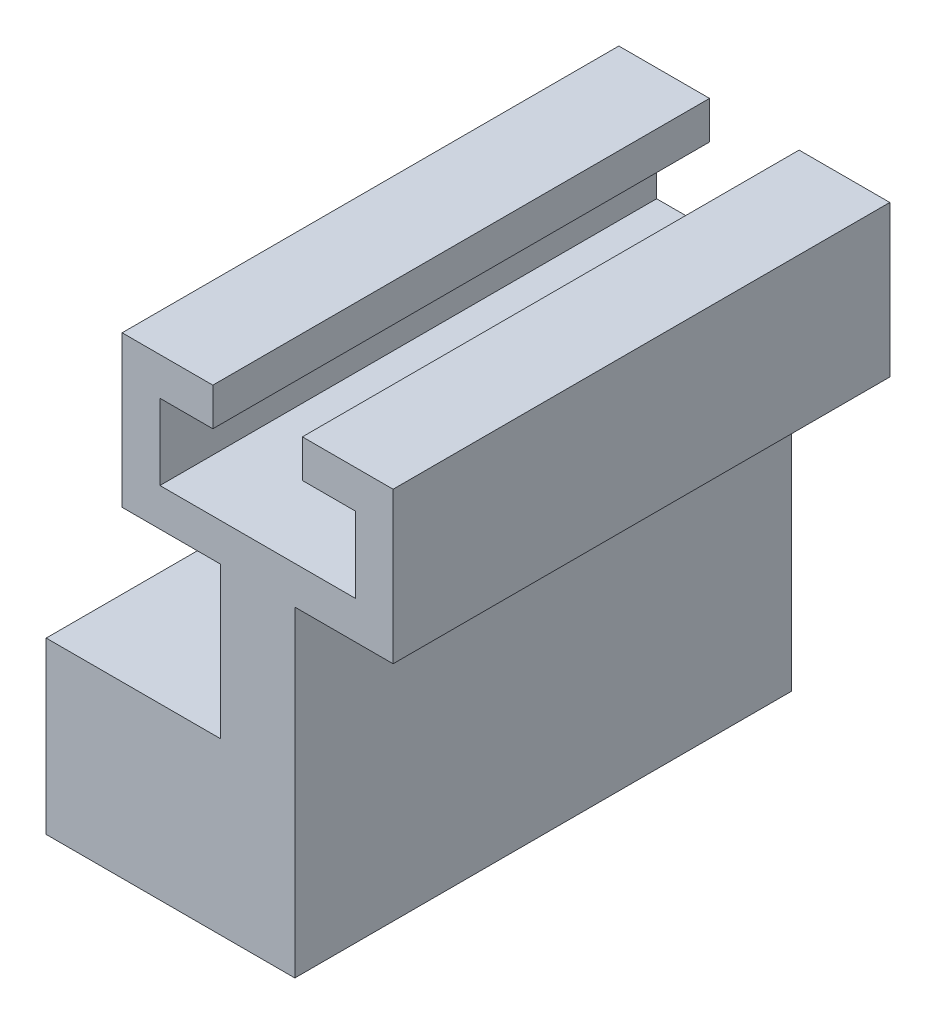
ISO-10303-21;
HEADER;
FILE_DESCRIPTION(('STEP AP214'),'2;1');
FILE_NAME('part.step','',(''),(''),'','','');
FILE_SCHEMA(('AUTOMOTIVE_DESIGN { 1 0 10303 214 1 1 1 1 }'));
ENDSEC;
DATA;
#1=APPLICATION_CONTEXT('core data for automotive mechanical design processes');
#2=APPLICATION_PROTOCOL_DEFINITION('international standard','automotive_design',2000,#1);
#3=PRODUCT_CONTEXT('',#1,'mechanical');
#4=PRODUCT('Part','Part','',(#3));
#5=PRODUCT_RELATED_PRODUCT_CATEGORY('part','',(#4));
#6=PRODUCT_DEFINITION_FORMATION('','',#4);
#7=PRODUCT_DEFINITION_CONTEXT('part definition',#1,'design');
#8=PRODUCT_DEFINITION('design','',#6,#7);
#9=PRODUCT_DEFINITION_SHAPE('','',#8);
#10=(LENGTH_UNIT() NAMED_UNIT(*) SI_UNIT(.MILLI.,.METRE.));
#11=(NAMED_UNIT(*) PLANE_ANGLE_UNIT() SI_UNIT($,.RADIAN.));
#12=(NAMED_UNIT(*) SI_UNIT($,.STERADIAN.) SOLID_ANGLE_UNIT());
#13=UNCERTAINTY_MEASURE_WITH_UNIT(LENGTH_MEASURE(1.E-05),#10,'distance_accuracy_value','');
#14=(GEOMETRIC_REPRESENTATION_CONTEXT(3) GLOBAL_UNCERTAINTY_ASSIGNED_CONTEXT((#13)) GLOBAL_UNIT_ASSIGNED_CONTEXT((#10,
#11,#12)) REPRESENTATION_CONTEXT('',''));
#15=CARTESIAN_POINT('',(0.,0.,0.));
#16=DIRECTION('',(0.,0.,1.));
#17=DIRECTION('',(1.,0.,0.));
#18=AXIS2_PLACEMENT_3D('',#15,#16,#17);
#19=CARTESIAN_POINT('',(29.5687475770863,114.314789442006,50.8917867539628));
#20=DIRECTION('',(1.,0.,0.));
#21=DIRECTION('',(0.,0.,-1.));
#22=AXIS2_PLACEMENT_3D('',#19,#20,#21);
#23=PLANE('',#22);
#24=DIRECTION('',(0.,0.,1.));
#25=VECTOR('',#24,1.);
#26=CARTESIAN_POINT('',(29.5687475770863,111.774789442006,50.8917867539628));
#27=LINE('',#26,#25);
#28=CARTESIAN_POINT('',(29.5687475770863,111.774789442006,50.8917867539628));
#29=VERTEX_POINT('',#28);
#30=CARTESIAN_POINT('',(29.5687475770863,111.774789442006,84.2728112382394));
#31=VERTEX_POINT('',#30);
#32=EDGE_CURVE('E203',#29,#31,#27,.T.);
#33=ORIENTED_EDGE('',*,*,#32,.F.);
#34=DIRECTION('',(0.,-1.,0.));
#35=VECTOR('',#34,1.);
#36=CARTESIAN_POINT('',(29.5687475770863,114.314789442006,50.8917867539628));
#37=LINE('',#36,#35);
#38=CARTESIAN_POINT('',(29.5687475770863,106.694789442006,50.8917867539628));
#39=VERTEX_POINT('',#38);
#40=EDGE_CURVE('E54',#29,#39,#37,.T.);
#41=ORIENTED_EDGE('',*,*,#40,.T.);
#42=DIRECTION('',(0.,0.,1.));
#43=VECTOR('',#42,1.);
#44=CARTESIAN_POINT('',(29.5687475770863,106.694789442006,50.8917867539628));
#45=LINE('',#44,#43);
#46=CARTESIAN_POINT('',(29.5687475770863,106.694789442006,84.2728112382394));
#47=VERTEX_POINT('',#46);
#48=EDGE_CURVE('E238',#39,#47,#45,.T.);
#49=ORIENTED_EDGE('',*,*,#48,.T.);
#50=DIRECTION('',(0.,-1.,0.));
#51=VECTOR('',#50,1.);
#52=CARTESIAN_POINT('',(29.5687475770863,114.314789442006,84.2728112382394));
#53=LINE('',#52,#51);
#54=EDGE_CURVE('E62',#31,#47,#53,.T.);
#55=ORIENTED_EDGE('',*,*,#54,.F.);
#56=EDGE_LOOP('',(#33,#41,#49,#55));
#57=FACE_BOUND('',#56,.T.);
#58=ADVANCED_FACE('F39',(#57),#23,.F.);
#59=CARTESIAN_POINT('',(16.438213762118,114.314789442006,50.8917867539628));
#60=DIRECTION('',(-1.,0.,0.));
#61=DIRECTION('',(0.,0.,1.));
#62=AXIS2_PLACEMENT_3D('',#59,#60,#61);
#63=PLANE('',#62);
#64=DIRECTION('',(0.,0.,-1.));
#65=VECTOR('',#64,1.);
#66=CARTESIAN_POINT('',(16.438213762118,111.774789442006,84.2728112382394));
#67=LINE('',#66,#65);
#68=CARTESIAN_POINT('',(16.438213762118,111.774789442006,84.2728112382394));
#69=VERTEX_POINT('',#68);
#70=CARTESIAN_POINT('',(16.438213762118,111.774789442006,50.8917867539628));
#71=VERTEX_POINT('',#70);
#72=EDGE_CURVE('E220',#69,#71,#67,.T.);
#73=ORIENTED_EDGE('',*,*,#72,.F.);
#74=DIRECTION('',(0.,-1.,0.));
#75=VECTOR('',#74,1.);
#76=CARTESIAN_POINT('',(16.438213762118,114.314789442006,84.2728112382394));
#77=LINE('',#76,#75);
#78=CARTESIAN_POINT('',(16.438213762118,106.694789442006,84.2728112382394));
#79=VERTEX_POINT('',#78);
#80=EDGE_CURVE('E263',#69,#79,#77,.T.);
#81=ORIENTED_EDGE('',*,*,#80,.T.);
#82=DIRECTION('',(0.,0.,-1.));
#83=VECTOR('',#82,1.);
#84=CARTESIAN_POINT('',(16.438213762118,106.694789442006,50.8917867539628));
#85=LINE('',#84,#83);
#86=CARTESIAN_POINT('',(16.438213762118,106.694789442006,50.8917867539628));
#87=VERTEX_POINT('',#86);
#88=EDGE_CURVE('E250',#79,#87,#85,.T.);
#89=ORIENTED_EDGE('',*,*,#88,.T.);
#90=DIRECTION('',(0.,-1.,0.));
#91=VECTOR('',#90,1.);
#92=CARTESIAN_POINT('',(16.438213762118,114.314789442006,50.8917867539628));
#93=LINE('',#92,#91);
#94=EDGE_CURVE('E259',#71,#87,#93,.T.);
#95=ORIENTED_EDGE('',*,*,#94,.F.);
#96=EDGE_LOOP('',(#73,#81,#89,#95));
#97=FACE_BOUND('',#96,.T.);
#98=ADVANCED_FACE('F343',(#97),#63,.F.);
#99=CARTESIAN_POINT('',(0.,106.694789442006,0.));
#100=DIRECTION('',(0.,1.,0.));
#101=DIRECTION('',(0.,0.,1.));
#102=AXIS2_PLACEMENT_3D('',#99,#100,#101);
#103=PLANE('',#102);
#104=DIRECTION('',(1.,0.,0.));
#105=VECTOR('',#104,1.);
#106=CARTESIAN_POINT('',(13.898213762118,106.694789442006,84.2728112382394));
#107=LINE('',#106,#105);
#108=EDGE_CURVE('E266',#79,#47,#107,.T.);
#109=ORIENTED_EDGE('',*,*,#108,.T.);
#110=ORIENTED_EDGE('',*,*,#48,.F.);
#111=DIRECTION('',(-1.,0.,0.));
#112=VECTOR('',#111,1.);
#113=CARTESIAN_POINT('',(13.898213762118,106.694789442006,50.8917867539628));
#114=LINE('',#113,#112);
#115=EDGE_CURVE('E268',#39,#87,#114,.T.);
#116=ORIENTED_EDGE('',*,*,#115,.T.);
#117=ORIENTED_EDGE('',*,*,#88,.F.);
#118=EDGE_LOOP('',(#109,#110,#116,#117));
#119=FACE_BOUND('',#118,.T.);
#120=ADVANCED_FACE('F347',(#119),#103,.T.);
#121=CARTESIAN_POINT('',(39.6064196005094,93.994789442006,18.2608112382394));
#122=DIRECTION('',(0.,1.,0.));
#123=DIRECTION('',(0.,0.,-1.));
#124=AXIS2_PLACEMENT_3D('',#121,#122,#123);
#125=PLANE('',#124);
#126=CARTESIAN_POINT('',(14.6486024196339,93.994789442006,56.7337867539628));
#127=DIRECTION('',(0.,1.,0.));
#128=DIRECTION('',(-1.,0.,0.));
#129=AXIS2_PLACEMENT_3D('',#126,#127,#128);
#130=CIRCLE('',#129,2.);
#131=CARTESIAN_POINT('',(12.6486024196339,93.994789442006,56.7337867539628));
#132=VERTEX_POINT('',#131);
#133=EDGE_CURVE('E195',#132,#132,#130,.T.);
#134=ORIENTED_EDGE('',*,*,#133,.F.);
#135=EDGE_LOOP('',(#134));
#136=FACE_BOUND('',#135,.T.);
#137=CARTESIAN_POINT('',(14.6486024196339,93.994789442006,74.1128112382394));
#138=DIRECTION('',(0.,1.,0.));
#139=DIRECTION('',(-1.,0.,0.));
#140=AXIS2_PLACEMENT_3D('',#137,#138,#139);
#141=CIRCLE('',#140,2.);
#142=CARTESIAN_POINT('',(12.6486024196339,93.994789442006,74.1128112382394));
#143=VERTEX_POINT('',#142);
#144=EDGE_CURVE('E198',#143,#143,#141,.T.);
#145=ORIENTED_EDGE('',*,*,#144,.F.);
#146=EDGE_LOOP('',(#145));
#147=FACE_BOUND('',#146,.T.);
#148=DIRECTION('',(1.,0.,0.));
#149=VECTOR('',#148,1.);
#150=CARTESIAN_POINT('',(30.7164196005094,93.994789442006,84.2728112382394));
#151=LINE('',#150,#149);
#152=CARTESIAN_POINT('',(8.79499107714986,93.994789442006,84.2728112382394));
#153=VERTEX_POINT('',#152);
#154=CARTESIAN_POINT('',(20.502213762118,93.994789442006,84.2728112382394));
#155=VERTEX_POINT('',#154);
#156=EDGE_CURVE('E313',#153,#155,#151,.T.);
#157=ORIENTED_EDGE('',*,*,#156,.T.);
#158=DIRECTION('',(0.,0.,1.));
#159=VECTOR('',#158,1.);
#160=CARTESIAN_POINT('',(20.502213762118,93.994789442006,50.8917867539628));
#161=LINE('',#160,#159);
#162=CARTESIAN_POINT('',(20.502213762118,93.994789442006,50.8917867539628));
#163=VERTEX_POINT('',#162);
#164=EDGE_CURVE('E294',#163,#155,#161,.T.);
#165=ORIENTED_EDGE('',*,*,#164,.F.);
#166=DIRECTION('',(-1.,0.,0.));
#167=VECTOR('',#166,1.);
#168=CARTESIAN_POINT('',(30.7164196005094,93.994789442006,50.8917867539628));
#169=LINE('',#168,#167);
#170=CARTESIAN_POINT('',(8.79499107714986,93.994789442006,50.8917867539628));
#171=VERTEX_POINT('',#170);
#172=EDGE_CURVE('E177',#163,#171,#169,.T.);
#173=ORIENTED_EDGE('',*,*,#172,.T.);
#174=DIRECTION('',(0.,0.,-1.));
#175=VECTOR('',#174,1.);
#176=CARTESIAN_POINT('',(8.79499107714986,93.994789442006,50.8917867539628));
#177=LINE('',#176,#175);
#178=EDGE_CURVE('E191',#153,#171,#177,.T.);
#179=ORIENTED_EDGE('',*,*,#178,.F.);
#180=EDGE_LOOP('',(#157,#165,#173,#179));
#181=FACE_BOUND('',#180,.T.);
#182=ADVANCED_FACE('F316',(#136,#147,#181),#125,.T.);
#183=CARTESIAN_POINT('',(103.857775327079,6.00376495772942,84.2728112382394));
#184=DIRECTION('',(0.,0.,1.));
#185=DIRECTION('',(1.,0.,0.));
#186=AXIS2_PLACEMENT_3D('',#183,#184,#185);
#187=PLANE('',#186);
#188=DIRECTION('',(-1.,0.,0.));
#189=VECTOR('',#188,1.);
#190=CARTESIAN_POINT('',(103.857775327079,82.5647894420061,84.2728112382394));
#191=LINE('',#190,#189);
#192=CARTESIAN_POINT('',(25.5047475770863,82.564789442006,84.2728112382394));
#193=VERTEX_POINT('',#192);
#194=CARTESIAN_POINT('',(8.79499107714986,82.564789442006,84.2728112382394));
#195=VERTEX_POINT('',#194);
#196=EDGE_CURVE('E182',#193,#195,#191,.T.);
#197=ORIENTED_EDGE('',*,*,#196,.F.);
#198=DIRECTION('',(0.,-1.,0.));
#199=VECTOR('',#198,1.);
#200=CARTESIAN_POINT('',(25.5047475770863,104.154789442006,84.2728112382394));
#201=LINE('',#200,#199);
#202=CARTESIAN_POINT('',(25.5047475770863,104.154789442006,84.2728112382394));
#203=VERTEX_POINT('',#202);
#204=EDGE_CURVE('E301',#203,#193,#201,.T.);
#205=ORIENTED_EDGE('',*,*,#204,.F.);
#206=DIRECTION('',(1.,0.,0.));
#207=VECTOR('',#206,1.);
#208=CARTESIAN_POINT('',(13.898213762118,104.154789442006,84.2728112382394));
#209=LINE('',#208,#207);
#210=CARTESIAN_POINT('',(32.1087475770863,104.154789442006,84.2728112382394));
#211=VERTEX_POINT('',#210);
#212=EDGE_CURVE('E275',#203,#211,#209,.T.);
#213=ORIENTED_EDGE('',*,*,#212,.T.);
#214=DIRECTION('',(0.,-1.,0.));
#215=VECTOR('',#214,1.);
#216=CARTESIAN_POINT('',(32.1087475770863,106.694789442006,84.2728112382394));
#217=LINE('',#216,#215);
#218=CARTESIAN_POINT('',(32.1087475770863,114.314789442006,84.2728112382394));
#219=VERTEX_POINT('',#218);
#220=EDGE_CURVE('E288',#219,#211,#217,.T.);
#221=ORIENTED_EDGE('',*,*,#220,.F.);
#222=DIRECTION('',(1.,0.,0.));
#223=VECTOR('',#222,1.);
#224=CARTESIAN_POINT('',(32.1087475770863,114.314789442006,84.2728112382394));
#225=LINE('',#224,#223);
#226=CARTESIAN_POINT('',(26.0127475770863,114.314789442006,84.2728112382394));
#227=VERTEX_POINT('',#226);
#228=EDGE_CURVE('E244',#227,#219,#225,.T.);
#229=ORIENTED_EDGE('',*,*,#228,.F.);
#230=DIRECTION('',(0.,1.,0.));
#231=VECTOR('',#230,1.);
#232=CARTESIAN_POINT('',(26.0127475770863,114.314789442006,84.2728112382394));
#233=LINE('',#232,#231);
#234=CARTESIAN_POINT('',(26.0127475770863,111.774789442006,84.2728112382394));
#235=VERTEX_POINT('',#234);
#236=EDGE_CURVE('E209',#235,#227,#233,.T.);
#237=ORIENTED_EDGE('',*,*,#236,.F.);
#238=DIRECTION('',(1.,0.,0.));
#239=VECTOR('',#238,1.);
#240=CARTESIAN_POINT('',(26.0127475770863,111.774789442006,84.2728112382394));
#241=LINE('',#240,#239);
#242=EDGE_CURVE('E215',#235,#31,#241,.T.);
#243=ORIENTED_EDGE('',*,*,#242,.T.);
#244=ORIENTED_EDGE('',*,*,#54,.T.);
#245=ORIENTED_EDGE('',*,*,#108,.F.);
#246=ORIENTED_EDGE('',*,*,#80,.F.);
#247=DIRECTION('',(-1.,0.,0.));
#248=VECTOR('',#247,1.);
#249=CARTESIAN_POINT('',(19.994213762118,111.774789442006,84.2728112382394));
#250=LINE('',#249,#248);
#251=CARTESIAN_POINT('',(19.994213762118,111.774789442006,84.2728112382394));
#252=VERTEX_POINT('',#251);
#253=EDGE_CURVE('E236',#252,#69,#250,.T.);
#254=ORIENTED_EDGE('',*,*,#253,.F.);
#255=DIRECTION('',(0.,-1.,0.));
#256=VECTOR('',#255,1.);
#257=CARTESIAN_POINT('',(19.994213762118,114.314789442006,84.2728112382394));
#258=LINE('',#257,#256);
#259=CARTESIAN_POINT('',(19.994213762118,114.314789442006,84.2728112382394));
#260=VERTEX_POINT('',#259);
#261=EDGE_CURVE('E221',#260,#252,#258,.T.);
#262=ORIENTED_EDGE('',*,*,#261,.F.);
#263=DIRECTION('',(1.,0.,0.));
#264=VECTOR('',#263,1.);
#265=CARTESIAN_POINT('',(13.898213762118,114.314789442006,84.2728112382394));
#266=LINE('',#265,#264);
#267=CARTESIAN_POINT('',(13.898213762118,114.314789442006,84.2728112382394));
#268=VERTEX_POINT('',#267);
#269=EDGE_CURVE('E254',#268,#260,#266,.T.);
#270=ORIENTED_EDGE('',*,*,#269,.F.);
#271=DIRECTION('',(0.,-1.,0.));
#272=VECTOR('',#271,1.);
#273=CARTESIAN_POINT('',(13.898213762118,106.694789442006,84.2728112382394));
#274=LINE('',#273,#272);
#275=CARTESIAN_POINT('',(13.898213762118,104.154789442006,84.2728112382394));
#276=VERTEX_POINT('',#275);
#277=EDGE_CURVE('E291',#268,#276,#274,.T.);
#278=ORIENTED_EDGE('',*,*,#277,.T.);
#279=CARTESIAN_POINT('',(20.502213762118,104.154789442006,84.2728112382394));
#280=VERTEX_POINT('',#279);
#281=EDGE_CURVE('E276',#276,#280,#209,.T.);
#282=ORIENTED_EDGE('',*,*,#281,.T.);
#283=DIRECTION('',(0.,-1.,0.));
#284=VECTOR('',#283,1.);
#285=CARTESIAN_POINT('',(20.502213762118,104.154789442006,84.2728112382394));
#286=LINE('',#285,#284);
#287=EDGE_CURVE('E305',#280,#155,#286,.T.);
#288=ORIENTED_EDGE('',*,*,#287,.T.);
#289=ORIENTED_EDGE('',*,*,#156,.F.);
#290=DIRECTION('',(0.,1.,0.));
#291=VECTOR('',#290,1.);
#292=CARTESIAN_POINT('',(8.79499107714986,93.994789442006,84.2728112382394));
#293=LINE('',#292,#291);
#294=EDGE_CURVE('E186',#195,#153,#293,.T.);
#295=ORIENTED_EDGE('',*,*,#294,.F.);
#296=EDGE_LOOP('',(#197,#205,#213,#221,#229,#237,#243,#244,#245,#246,#254,#262,#270,#278,#282,
#288,#289,#295));
#297=FACE_BOUND('',#296,.T.);
#298=ADVANCED_FACE('F41',(#297),#187,.T.);
#299=CARTESIAN_POINT('',(37.8415077631308,87.644789442006,50.8917867539628));
#300=DIRECTION('',(0.,0.,1.));
#301=DIRECTION('',(1.,0.,0.));
#302=AXIS2_PLACEMENT_3D('',#299,#300,#301);
#303=PLANE('',#302);
#304=DIRECTION('',(0.,-1.,0.));
#305=VECTOR('',#304,1.);
#306=CARTESIAN_POINT('',(25.5047475770863,104.154789442006,50.8917867539628));
#307=LINE('',#306,#305);
#308=CARTESIAN_POINT('',(25.5047475770863,104.154789442006,50.8917867539628));
#309=VERTEX_POINT('',#308);
#310=CARTESIAN_POINT('',(25.5047475770863,82.564789442006,50.8917867539628));
#311=VERTEX_POINT('',#310);
#312=EDGE_CURVE('E174',#309,#311,#307,.T.);
#313=ORIENTED_EDGE('',*,*,#312,.T.);
#314=DIRECTION('',(-1.,0.,0.));
#315=VECTOR('',#314,1.);
#316=CARTESIAN_POINT('',(18.1327753270791,82.564789442006,50.8917867539628));
#317=LINE('',#316,#315);
#318=CARTESIAN_POINT('',(8.79499107714986,82.564789442006,50.8917867539628));
#319=VERTEX_POINT('',#318);
#320=EDGE_CURVE('E47',#311,#319,#317,.T.);
#321=ORIENTED_EDGE('',*,*,#320,.T.);
#322=DIRECTION('',(0.,-1.,0.));
#323=VECTOR('',#322,1.);
#324=CARTESIAN_POINT('',(8.79499107714986,93.994789442006,50.8917867539628));
#325=LINE('',#324,#323);
#326=EDGE_CURVE('E172',#171,#319,#325,.T.);
#327=ORIENTED_EDGE('',*,*,#326,.F.);
#328=ORIENTED_EDGE('',*,*,#172,.F.);
#329=DIRECTION('',(0.,-1.,0.));
#330=VECTOR('',#329,1.);
#331=CARTESIAN_POINT('',(20.502213762118,104.154789442006,50.8917867539628));
#332=LINE('',#331,#330);
#333=CARTESIAN_POINT('',(20.502213762118,104.154789442006,50.8917867539628));
#334=VERTEX_POINT('',#333);
#335=EDGE_CURVE('E308',#334,#163,#332,.T.);
#336=ORIENTED_EDGE('',*,*,#335,.F.);
#337=DIRECTION('',(-1.,0.,0.));
#338=VECTOR('',#337,1.);
#339=CARTESIAN_POINT('',(13.898213762118,104.154789442006,50.8917867539628));
#340=LINE('',#339,#338);
#341=CARTESIAN_POINT('',(13.898213762118,104.154789442006,50.8917867539628));
#342=VERTEX_POINT('',#341);
#343=EDGE_CURVE('E281',#334,#342,#340,.T.);
#344=ORIENTED_EDGE('',*,*,#343,.T.);
#345=DIRECTION('',(0.,-1.,0.));
#346=VECTOR('',#345,1.);
#347=CARTESIAN_POINT('',(13.898213762118,106.694789442006,50.8917867539628));
#348=LINE('',#347,#346);
#349=CARTESIAN_POINT('',(13.898213762118,114.314789442006,50.8917867539628));
#350=VERTEX_POINT('',#349);
#351=EDGE_CURVE('E272',#350,#342,#348,.T.);
#352=ORIENTED_EDGE('',*,*,#351,.F.);
#353=DIRECTION('',(-1.,0.,0.));
#354=VECTOR('',#353,1.);
#355=CARTESIAN_POINT('',(13.898213762118,114.314789442006,50.8917867539628));
#356=LINE('',#355,#354);
#357=CARTESIAN_POINT('',(19.994213762118,114.314789442006,50.8917867539628));
#358=VERTEX_POINT('',#357);
#359=EDGE_CURVE('E256',#358,#350,#356,.T.);
#360=ORIENTED_EDGE('',*,*,#359,.F.);
#361=DIRECTION('',(0.,1.,0.));
#362=VECTOR('',#361,1.);
#363=CARTESIAN_POINT('',(19.994213762118,114.314789442006,50.8917867539628));
#364=LINE('',#363,#362);
#365=CARTESIAN_POINT('',(19.994213762118,111.774789442006,50.8917867539628));
#366=VERTEX_POINT('',#365);
#367=EDGE_CURVE('E226',#366,#358,#364,.T.);
#368=ORIENTED_EDGE('',*,*,#367,.F.);
#369=DIRECTION('',(-1.,0.,0.));
#370=VECTOR('',#369,1.);
#371=CARTESIAN_POINT('',(19.994213762118,111.774789442006,50.8917867539628));
#372=LINE('',#371,#370);
#373=EDGE_CURVE('E232',#366,#71,#372,.T.);
#374=ORIENTED_EDGE('',*,*,#373,.T.);
#375=ORIENTED_EDGE('',*,*,#94,.T.);
#376=ORIENTED_EDGE('',*,*,#115,.F.);
#377=ORIENTED_EDGE('',*,*,#40,.F.);
#378=DIRECTION('',(1.,0.,0.));
#379=VECTOR('',#378,1.);
#380=CARTESIAN_POINT('',(26.0127475770863,111.774789442006,50.8917867539628));
#381=LINE('',#380,#379);
#382=CARTESIAN_POINT('',(26.0127475770863,111.774789442006,50.8917867539628));
#383=VERTEX_POINT('',#382);
#384=EDGE_CURVE('E218',#383,#29,#381,.T.);
#385=ORIENTED_EDGE('',*,*,#384,.F.);
#386=DIRECTION('',(0.,-1.,0.));
#387=VECTOR('',#386,1.);
#388=CARTESIAN_POINT('',(26.0127475770863,114.314789442006,50.8917867539628));
#389=LINE('',#388,#387);
#390=CARTESIAN_POINT('',(26.0127475770863,114.314789442006,50.8917867539628));
#391=VERTEX_POINT('',#390);
#392=EDGE_CURVE('E204',#391,#383,#389,.T.);
#393=ORIENTED_EDGE('',*,*,#392,.F.);
#394=DIRECTION('',(-1.,0.,0.));
#395=VECTOR('',#394,1.);
#396=CARTESIAN_POINT('',(32.1087475770863,114.314789442006,50.8917867539628));
#397=LINE('',#396,#395);
#398=CARTESIAN_POINT('',(32.1087475770863,114.314789442006,50.8917867539628));
#399=VERTEX_POINT('',#398);
#400=EDGE_CURVE('E242',#399,#391,#397,.T.);
#401=ORIENTED_EDGE('',*,*,#400,.F.);
#402=DIRECTION('',(0.,-1.,0.));
#403=VECTOR('',#402,1.);
#404=CARTESIAN_POINT('',(32.1087475770863,106.694789442006,50.8917867539628));
#405=LINE('',#404,#403);
#406=CARTESIAN_POINT('',(32.1087475770863,104.154789442006,50.8917867539628));
#407=VERTEX_POINT('',#406);
#408=EDGE_CURVE('E285',#399,#407,#405,.T.);
#409=ORIENTED_EDGE('',*,*,#408,.T.);
#410=EDGE_CURVE('E269',#407,#309,#340,.T.);
#411=ORIENTED_EDGE('',*,*,#410,.T.);
#412=EDGE_LOOP('',(#313,#321,#327,#328,#336,#344,#352,#360,#368,#374,#375,#376,#377,#385,#393,
#401,#409,#411));
#413=FACE_BOUND('',#412,.T.);
#414=ADVANCED_FACE('F169',(#413),#303,.F.);
#415=CARTESIAN_POINT('',(0.,82.564789442006,0.));
#416=DIRECTION('',(0.,1.,0.));
#417=DIRECTION('',(-1.,0.,0.));
#418=AXIS2_PLACEMENT_3D('',#415,#416,#417);
#419=PLANE('',#418);
#420=CARTESIAN_POINT('',(14.6486024196339,82.564789442006,56.7337867539628));
#421=DIRECTION('',(0.,1.,0.));
#422=DIRECTION('',(-1.,0.,0.));
#423=AXIS2_PLACEMENT_3D('',#420,#421,#422);
#424=CIRCLE('',#423,2.);
#425=CARTESIAN_POINT('',(12.6486024196339,82.564789442006,56.7337867539628));
#426=VERTEX_POINT('',#425);
#427=EDGE_CURVE('E192',#426,#426,#424,.T.);
#428=ORIENTED_EDGE('',*,*,#427,.T.);
#429=EDGE_LOOP('',(#428));
#430=FACE_BOUND('',#429,.T.);
#431=CARTESIAN_POINT('',(14.6486024196339,82.564789442006,74.1128112382394));
#432=DIRECTION('',(0.,1.,0.));
#433=DIRECTION('',(-1.,0.,0.));
#434=AXIS2_PLACEMENT_3D('',#431,#432,#433);
#435=CIRCLE('',#434,2.);
#436=CARTESIAN_POINT('',(12.6486024196339,82.564789442006,74.1128112382394));
#437=VERTEX_POINT('',#436);
#438=EDGE_CURVE('E618',#437,#437,#435,.T.);
#439=ORIENTED_EDGE('',*,*,#438,.T.);
#440=EDGE_LOOP('',(#439));
#441=FACE_BOUND('',#440,.T.);
#442=ORIENTED_EDGE('',*,*,#320,.F.);
#443=DIRECTION('',(0.,0.,1.));
#444=VECTOR('',#443,1.);
#445=CARTESIAN_POINT('',(25.5047475770863,82.564789442006,0.));
#446=LINE('',#445,#444);
#447=EDGE_CURVE('E11',#311,#193,#446,.T.);
#448=ORIENTED_EDGE('',*,*,#447,.T.);
#449=ORIENTED_EDGE('',*,*,#196,.T.);
#450=DIRECTION('',(0.,0.,1.));
#451=VECTOR('',#450,1.);
#452=CARTESIAN_POINT('',(8.79499107714986,82.564789442006,50.8917867539628));
#453=LINE('',#452,#451);
#454=EDGE_CURVE('E179',#319,#195,#453,.T.);
#455=ORIENTED_EDGE('',*,*,#454,.F.);
#456=EDGE_LOOP('',(#442,#448,#449,#455));
#457=FACE_BOUND('',#456,.T.);
#458=ADVANCED_FACE('F180',(#430,#441,#457),#419,.F.);
#459=CARTESIAN_POINT('',(25.5047475770863,104.154789442006,50.8917867539628));
#460=DIRECTION('',(-1.,0.,0.));
#461=DIRECTION('',(0.,-1.,0.));
#462=AXIS2_PLACEMENT_3D('',#459,#460,#461);
#463=PLANE('',#462);
#464=ORIENTED_EDGE('',*,*,#204,.T.);
#465=ORIENTED_EDGE('',*,*,#447,.F.);
#466=ORIENTED_EDGE('',*,*,#312,.F.);
#467=DIRECTION('',(0.,0.,-1.));
#468=VECTOR('',#467,1.);
#469=CARTESIAN_POINT('',(25.5047475770863,104.154789442006,50.8917867539628));
#470=LINE('',#469,#468);
#471=EDGE_CURVE('E295',#203,#309,#470,.T.);
#472=ORIENTED_EDGE('',*,*,#471,.F.);
#473=EDGE_LOOP('',(#464,#465,#466,#472));
#474=FACE_BOUND('',#473,.T.);
#475=ADVANCED_FACE('F380',(#474),#463,.F.);
#476=CARTESIAN_POINT('',(20.502213762118,104.154789442006,50.8917867539628));
#477=DIRECTION('',(1.,0.,0.));
#478=DIRECTION('',(0.,1.,0.));
#479=AXIS2_PLACEMENT_3D('',#476,#477,#478);
#480=PLANE('',#479);
#481=ORIENTED_EDGE('',*,*,#164,.T.);
#482=ORIENTED_EDGE('',*,*,#287,.F.);
#483=DIRECTION('',(0.,0.,1.));
#484=VECTOR('',#483,1.);
#485=CARTESIAN_POINT('',(20.502213762118,104.154789442006,50.8917867539628));
#486=LINE('',#485,#484);
#487=EDGE_CURVE('E298',#334,#280,#486,.T.);
#488=ORIENTED_EDGE('',*,*,#487,.F.);
#489=ORIENTED_EDGE('',*,*,#335,.T.);
#490=EDGE_LOOP('',(#481,#482,#488,#489));
#491=FACE_BOUND('',#490,.T.);
#492=ADVANCED_FACE('F318',(#491),#480,.F.);
#493=CARTESIAN_POINT('',(0.,104.154789442006,0.));
#494=DIRECTION('',(0.,1.,0.));
#495=DIRECTION('',(0.,0.,1.));
#496=AXIS2_PLACEMENT_3D('',#493,#494,#495);
#497=PLANE('',#496);
#498=ORIENTED_EDGE('',*,*,#212,.F.);
#499=ORIENTED_EDGE('',*,*,#471,.T.);
#500=ORIENTED_EDGE('',*,*,#410,.F.);
#501=DIRECTION('',(0.,0.,-1.));
#502=VECTOR('',#501,1.);
#503=CARTESIAN_POINT('',(32.1087475770863,104.154789442006,50.8917867539628));
#504=LINE('',#503,#502);
#505=EDGE_CURVE('E279',#211,#407,#504,.T.);
#506=ORIENTED_EDGE('',*,*,#505,.F.);
#507=EDGE_LOOP('',(#498,#499,#500,#506));
#508=FACE_BOUND('',#507,.T.);
#509=ADVANCED_FACE('F369',(#508),#497,.F.);
#510=ORIENTED_EDGE('',*,*,#343,.F.);
#511=ORIENTED_EDGE('',*,*,#487,.T.);
#512=ORIENTED_EDGE('',*,*,#281,.F.);
#513=DIRECTION('',(0.,0.,1.));
#514=VECTOR('',#513,1.);
#515=CARTESIAN_POINT('',(13.898213762118,104.154789442006,50.8917867539628));
#516=LINE('',#515,#514);
#517=EDGE_CURVE('E265',#342,#276,#516,.T.);
#518=ORIENTED_EDGE('',*,*,#517,.F.);
#519=EDGE_LOOP('',(#510,#511,#512,#518));
#520=FACE_BOUND('',#519,.T.);
#521=ADVANCED_FACE('F324',(#520),#497,.F.);
#522=CARTESIAN_POINT('',(13.898213762118,106.694789442006,50.8917867539628));
#523=DIRECTION('',(1.,0.,0.));
#524=DIRECTION('',(0.,0.,-1.));
#525=AXIS2_PLACEMENT_3D('',#522,#523,#524);
#526=PLANE('',#525);
#527=ORIENTED_EDGE('',*,*,#517,.T.);
#528=ORIENTED_EDGE('',*,*,#277,.F.);
#529=DIRECTION('',(0.,0.,1.));
#530=VECTOR('',#529,1.);
#531=CARTESIAN_POINT('',(13.898213762118,114.314789442006,50.8917867539628));
#532=LINE('',#531,#530);
#533=EDGE_CURVE('E251',#350,#268,#532,.T.);
#534=ORIENTED_EDGE('',*,*,#533,.F.);
#535=ORIENTED_EDGE('',*,*,#351,.T.);
#536=EDGE_LOOP('',(#527,#528,#534,#535));
#537=FACE_BOUND('',#536,.T.);
#538=ADVANCED_FACE('F327',(#537),#526,.F.);
#539=CARTESIAN_POINT('',(32.1087475770863,106.694789442006,50.8917867539628));
#540=DIRECTION('',(-1.,0.,0.));
#541=DIRECTION('',(0.,0.,1.));
#542=AXIS2_PLACEMENT_3D('',#539,#540,#541);
#543=PLANE('',#542);
#544=ORIENTED_EDGE('',*,*,#505,.T.);
#545=ORIENTED_EDGE('',*,*,#408,.F.);
#546=DIRECTION('',(0.,0.,-1.));
#547=VECTOR('',#546,1.);
#548=CARTESIAN_POINT('',(32.1087475770863,114.314789442006,50.8917867539628));
#549=LINE('',#548,#547);
#550=EDGE_CURVE('E239',#219,#399,#549,.T.);
#551=ORIENTED_EDGE('',*,*,#550,.F.);
#552=ORIENTED_EDGE('',*,*,#220,.T.);
#553=EDGE_LOOP('',(#544,#545,#551,#552));
#554=FACE_BOUND('',#553,.T.);
#555=ADVANCED_FACE('F365',(#554),#543,.F.);
#556=CARTESIAN_POINT('',(0.,114.314789442006,0.));
#557=DIRECTION('',(0.,1.,0.));
#558=DIRECTION('',(0.,0.,1.));
#559=AXIS2_PLACEMENT_3D('',#556,#557,#558);
#560=PLANE('',#559);
#561=ORIENTED_EDGE('',*,*,#533,.T.);
#562=ORIENTED_EDGE('',*,*,#269,.T.);
#563=DIRECTION('',(0.,0.,1.));
#564=VECTOR('',#563,1.);
#565=CARTESIAN_POINT('',(19.994213762118,114.314789442006,84.2728112382394));
#566=LINE('',#565,#564);
#567=EDGE_CURVE('E229',#358,#260,#566,.T.);
#568=ORIENTED_EDGE('',*,*,#567,.F.);
#569=ORIENTED_EDGE('',*,*,#359,.T.);
#570=EDGE_LOOP('',(#561,#562,#568,#569));
#571=FACE_BOUND('',#570,.T.);
#572=ADVANCED_FACE('F329',(#571),#560,.T.);
#573=CARTESIAN_POINT('',(0.,114.314789442006,0.));
#574=DIRECTION('',(0.,-1.,0.));
#575=DIRECTION('',(0.,0.,-1.));
#576=AXIS2_PLACEMENT_3D('',#573,#574,#575);
#577=PLANE('',#576);
#578=ORIENTED_EDGE('',*,*,#550,.T.);
#579=ORIENTED_EDGE('',*,*,#400,.T.);
#580=DIRECTION('',(0.,0.,-1.));
#581=VECTOR('',#580,1.);
#582=CARTESIAN_POINT('',(26.0127475770863,114.314789442006,50.8917867539628));
#583=LINE('',#582,#581);
#584=EDGE_CURVE('E212',#227,#391,#583,.T.);
#585=ORIENTED_EDGE('',*,*,#584,.F.);
#586=ORIENTED_EDGE('',*,*,#228,.T.);
#587=EDGE_LOOP('',(#578,#579,#585,#586));
#588=FACE_BOUND('',#587,.T.);
#589=ADVANCED_FACE('F362',(#588),#577,.F.);
#590=CARTESIAN_POINT('',(19.994213762118,111.774789442006,84.2728112382394));
#591=DIRECTION('',(0.,1.,0.));
#592=DIRECTION('',(0.,0.,1.));
#593=AXIS2_PLACEMENT_3D('',#590,#591,#592);
#594=PLANE('',#593);
#595=ORIENTED_EDGE('',*,*,#72,.T.);
#596=ORIENTED_EDGE('',*,*,#373,.F.);
#597=DIRECTION('',(0.,0.,-1.));
#598=VECTOR('',#597,1.);
#599=CARTESIAN_POINT('',(19.994213762118,111.774789442006,84.2728112382394));
#600=LINE('',#599,#598);
#601=EDGE_CURVE('E224',#252,#366,#600,.T.);
#602=ORIENTED_EDGE('',*,*,#601,.F.);
#603=ORIENTED_EDGE('',*,*,#253,.T.);
#604=EDGE_LOOP('',(#595,#596,#602,#603));
#605=FACE_BOUND('',#604,.T.);
#606=ADVANCED_FACE('F338',(#605),#594,.F.);
#607=CARTESIAN_POINT('',(19.994213762118,0.,0.));
#608=DIRECTION('',(1.,0.,0.));
#609=DIRECTION('',(0.,0.,-1.));
#610=AXIS2_PLACEMENT_3D('',#607,#608,#609);
#611=PLANE('',#610);
#612=ORIENTED_EDGE('',*,*,#261,.T.);
#613=ORIENTED_EDGE('',*,*,#601,.T.);
#614=ORIENTED_EDGE('',*,*,#367,.T.);
#615=ORIENTED_EDGE('',*,*,#567,.T.);
#616=EDGE_LOOP('',(#612,#613,#614,#615));
#617=FACE_BOUND('',#616,.T.);
#618=ADVANCED_FACE('F333',(#617),#611,.T.);
#619=CARTESIAN_POINT('',(26.0127475770863,111.774789442006,50.8917867539628));
#620=DIRECTION('',(0.,1.,0.));
#621=DIRECTION('',(0.,0.,1.));
#622=AXIS2_PLACEMENT_3D('',#619,#620,#621);
#623=PLANE('',#622);
#624=ORIENTED_EDGE('',*,*,#32,.T.);
#625=ORIENTED_EDGE('',*,*,#242,.F.);
#626=DIRECTION('',(0.,0.,1.));
#627=VECTOR('',#626,1.);
#628=CARTESIAN_POINT('',(26.0127475770863,111.774789442006,50.8917867539628));
#629=LINE('',#628,#627);
#630=EDGE_CURVE('E207',#383,#235,#629,.T.);
#631=ORIENTED_EDGE('',*,*,#630,.F.);
#632=ORIENTED_EDGE('',*,*,#384,.T.);
#633=EDGE_LOOP('',(#624,#625,#631,#632));
#634=FACE_BOUND('',#633,.T.);
#635=ADVANCED_FACE('F352',(#634),#623,.F.);
#636=CARTESIAN_POINT('',(26.0127475770863,0.,0.));
#637=DIRECTION('',(-1.,0.,0.));
#638=DIRECTION('',(0.,0.,1.));
#639=AXIS2_PLACEMENT_3D('',#636,#637,#638);
#640=PLANE('',#639);
#641=ORIENTED_EDGE('',*,*,#392,.T.);
#642=ORIENTED_EDGE('',*,*,#630,.T.);
#643=ORIENTED_EDGE('',*,*,#236,.T.);
#644=ORIENTED_EDGE('',*,*,#584,.T.);
#645=EDGE_LOOP('',(#641,#642,#643,#644));
#646=FACE_BOUND('',#645,.T.);
#647=ADVANCED_FACE('F463',(#646),#640,.T.);
#648=CARTESIAN_POINT('',(8.79499107714986,0.,0.));
#649=DIRECTION('',(-1.,0.,0.));
#650=DIRECTION('',(0.,0.,1.));
#651=AXIS2_PLACEMENT_3D('',#648,#649,#650);
#652=PLANE('',#651);
#653=ORIENTED_EDGE('',*,*,#326,.T.);
#654=ORIENTED_EDGE('',*,*,#454,.T.);
#655=ORIENTED_EDGE('',*,*,#294,.T.);
#656=ORIENTED_EDGE('',*,*,#178,.T.);
#657=EDGE_LOOP('',(#653,#654,#655,#656));
#658=FACE_BOUND('',#657,.T.);
#659=ADVANCED_FACE('F189',(#658),#652,.T.);
#660=CARTESIAN_POINT('',(14.6486024196339,82.564789442006,74.1128112382394));
#661=DIRECTION('',(0.,1.,0.));
#662=DIRECTION('',(-1.,0.,0.));
#663=AXIS2_PLACEMENT_3D('',#660,#661,#662);
#664=CYLINDRICAL_SURFACE('',#663,2.);
#665=ORIENTED_EDGE('',*,*,#438,.F.);
#666=EDGE_LOOP('',(#665));
#667=FACE_BOUND('',#666,.T.);
#668=ORIENTED_EDGE('',*,*,#144,.T.);
#669=EDGE_LOOP('',(#668));
#670=FACE_BOUND('',#669,.T.);
#671=ADVANCED_FACE('F593',(#667,#670),#664,.F.);
#672=CARTESIAN_POINT('',(14.6486024196339,82.564789442006,56.7337867539628));
#673=DIRECTION('',(0.,1.,0.));
#674=DIRECTION('',(-1.,0.,0.));
#675=AXIS2_PLACEMENT_3D('',#672,#673,#674);
#676=CYLINDRICAL_SURFACE('',#675,2.);
#677=ORIENTED_EDGE('',*,*,#427,.F.);
#678=EDGE_LOOP('',(#677));
#679=FACE_BOUND('',#678,.T.);
#680=ORIENTED_EDGE('',*,*,#133,.T.);
#681=EDGE_LOOP('',(#680));
#682=FACE_BOUND('',#681,.T.);
#683=ADVANCED_FACE('F600',(#679,#682),#676,.F.);
#684=CLOSED_SHELL('',(#58,#98,#120,#182,#298,#414,#458,#475,#492,#509,#521,#538,#555,#572,#589,
#606,#618,#635,#647,#659,#671,#683));
#685=MANIFOLD_SOLID_BREP('B2',#684);
#686=ADVANCED_BREP_SHAPE_REPRESENTATION('',(#18,#685),#14);
#687=SHAPE_DEFINITION_REPRESENTATION(#9,#686);
ENDSEC;
END-ISO-10303-21;
